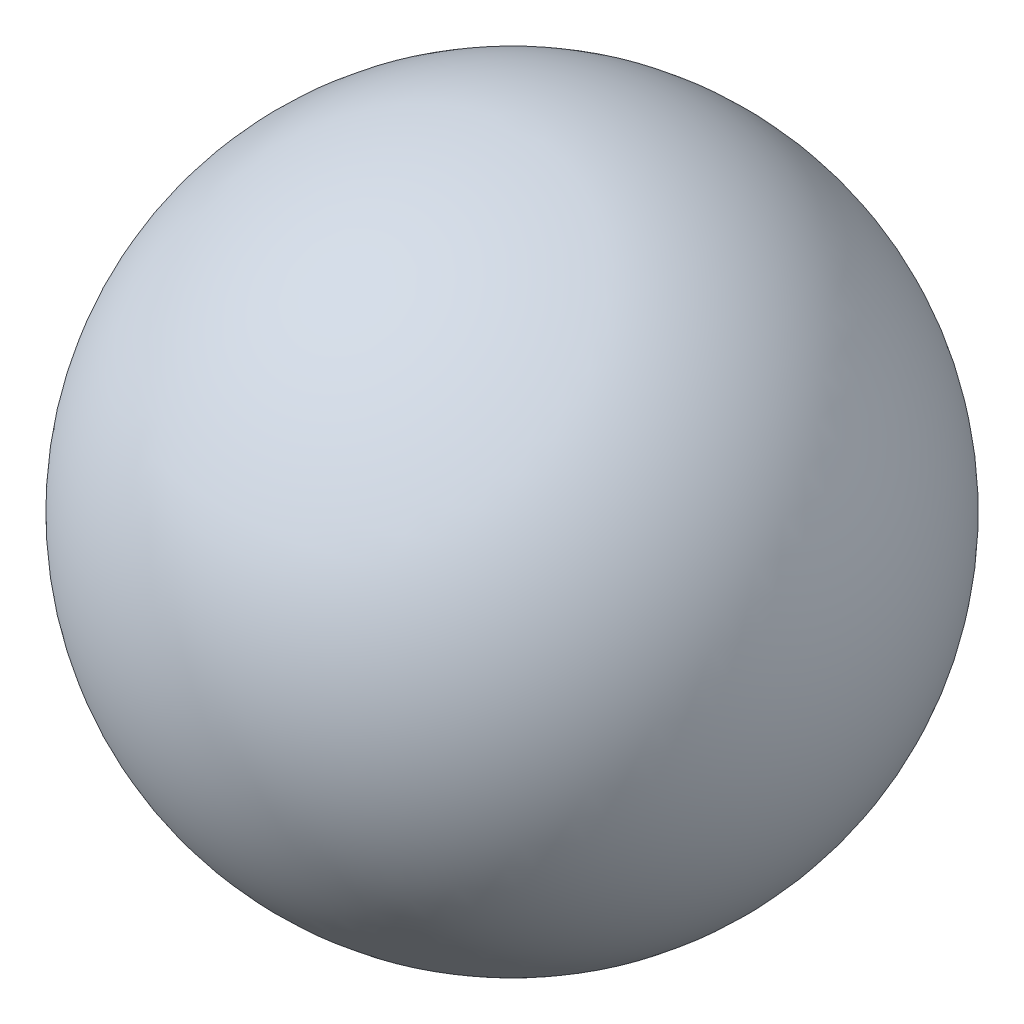
ISO-10303-21;
HEADER;
FILE_DESCRIPTION(('STEP AP214'),'2;1');
FILE_NAME('part.step','',(''),(''),'','','');
FILE_SCHEMA(('AUTOMOTIVE_DESIGN { 1 0 10303 214 1 1 1 1 }'));
ENDSEC;
DATA;
#1=APPLICATION_CONTEXT('core data for automotive mechanical design processes');
#2=APPLICATION_PROTOCOL_DEFINITION('international standard','automotive_design',2000,#1);
#3=PRODUCT_CONTEXT('',#1,'mechanical');
#4=PRODUCT('Part','Part','',(#3));
#5=PRODUCT_RELATED_PRODUCT_CATEGORY('part','',(#4));
#6=PRODUCT_DEFINITION_FORMATION('','',#4);
#7=PRODUCT_DEFINITION_CONTEXT('part definition',#1,'design');
#8=PRODUCT_DEFINITION('design','',#6,#7);
#9=PRODUCT_DEFINITION_SHAPE('','',#8);
#10=(LENGTH_UNIT() NAMED_UNIT(*) SI_UNIT(.MILLI.,.METRE.));
#11=(NAMED_UNIT(*) PLANE_ANGLE_UNIT() SI_UNIT($,.RADIAN.));
#12=(NAMED_UNIT(*) SI_UNIT($,.STERADIAN.) SOLID_ANGLE_UNIT());
#13=UNCERTAINTY_MEASURE_WITH_UNIT(LENGTH_MEASURE(1.E-05),#10,'distance_accuracy_value','');
#14=(GEOMETRIC_REPRESENTATION_CONTEXT(3) GLOBAL_UNCERTAINTY_ASSIGNED_CONTEXT((#13)) GLOBAL_UNIT_ASSIGNED_CONTEXT((#10,
#11,#12)) REPRESENTATION_CONTEXT('',''));
#15=CARTESIAN_POINT('',(0.,0.,0.));
#16=DIRECTION('',(0.,0.,1.));
#17=DIRECTION('',(1.,0.,0.));
#18=AXIS2_PLACEMENT_3D('',#15,#16,#17);
#19=CARTESIAN_POINT('',(0.,0.,0.));
#20=DIRECTION('',(0.,1.,0.));
#21=DIRECTION('',(1.,0.,0.));
#22=AXIS2_PLACEMENT_3D('',#19,#20,#21);
#23=SPHERICAL_SURFACE('',#22,88.9);
#24=CARTESIAN_POINT('',(0.,88.9,0.));
#25=VERTEX_POINT('',#24);
#26=VERTEX_LOOP('',#25);
#27=FACE_BOUND('',#26,.T.);
#28=ADVANCED_FACE('F28',(#27),#23,.T.);
#29=CLOSED_SHELL('',(#28));
#30=MANIFOLD_SOLID_BREP('B2',#29);
#31=ADVANCED_BREP_SHAPE_REPRESENTATION('',(#18,#30),#14);
#32=SHAPE_DEFINITION_REPRESENTATION(#9,#31);
ENDSEC;
END-ISO-10303-21;
